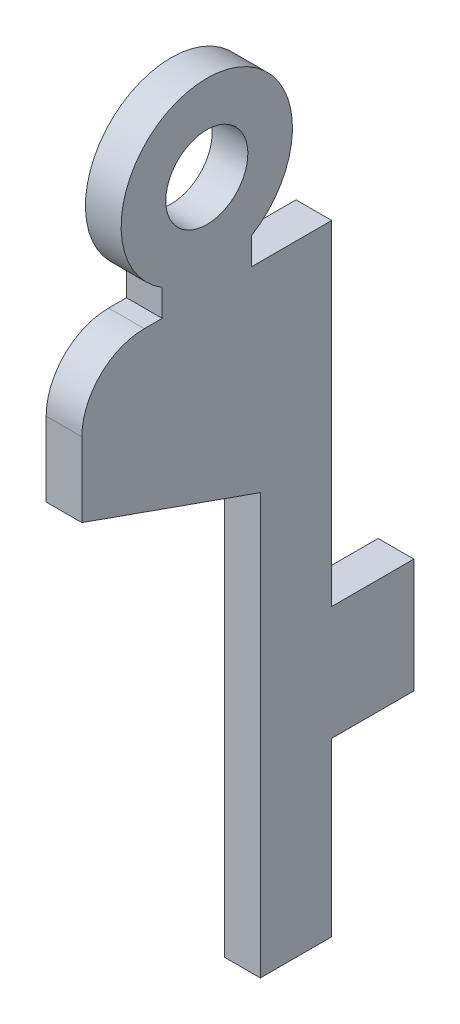
ISO-10303-21;
HEADER;
FILE_DESCRIPTION(('STEP AP214'),'2;1');
FILE_NAME('part.step','',(''),(''),'','','');
FILE_SCHEMA(('AUTOMOTIVE_DESIGN { 1 0 10303 214 1 1 1 1 }'));
ENDSEC;
DATA;
#1=APPLICATION_CONTEXT('core data for automotive mechanical design processes');
#2=APPLICATION_PROTOCOL_DEFINITION('international standard','automotive_design',2000,#1);
#3=PRODUCT_CONTEXT('',#1,'mechanical');
#4=PRODUCT('Part','Part','',(#3));
#5=PRODUCT_RELATED_PRODUCT_CATEGORY('part','',(#4));
#6=PRODUCT_DEFINITION_FORMATION('','',#4);
#7=PRODUCT_DEFINITION_CONTEXT('part definition',#1,'design');
#8=PRODUCT_DEFINITION('design','',#6,#7);
#9=PRODUCT_DEFINITION_SHAPE('','',#8);
#10=(LENGTH_UNIT() NAMED_UNIT(*) SI_UNIT(.MILLI.,.METRE.));
#11=(NAMED_UNIT(*) PLANE_ANGLE_UNIT() SI_UNIT($,.RADIAN.));
#12=(NAMED_UNIT(*) SI_UNIT($,.STERADIAN.) SOLID_ANGLE_UNIT());
#13=UNCERTAINTY_MEASURE_WITH_UNIT(LENGTH_MEASURE(1.E-05),#10,'distance_accuracy_value','');
#14=(GEOMETRIC_REPRESENTATION_CONTEXT(3) GLOBAL_UNCERTAINTY_ASSIGNED_CONTEXT((#13)) GLOBAL_UNIT_ASSIGNED_CONTEXT((#10,
#11,#12)) REPRESENTATION_CONTEXT('',''));
#15=CARTESIAN_POINT('',(0.,0.,0.));
#16=DIRECTION('',(0.,0.,1.));
#17=DIRECTION('',(1.,0.,0.));
#18=AXIS2_PLACEMENT_3D('',#15,#16,#17);
#19=CARTESIAN_POINT('',(-2.35,8.49175045506222,-7.7));
#20=DIRECTION('',(1.,0.,0.));
#21=DIRECTION('',(0.,1.,0.));
#22=AXIS2_PLACEMENT_3D('',#19,#20,#21);
#23=PLANE('',#22);
#24=CARTESIAN_POINT('',(-2.35,17.3808325195312,-6.55));
#25=DIRECTION('',(1.,0.,0.));
#26=DIRECTION('',(0.,1.,0.));
#27=AXIS2_PLACEMENT_3D('',#24,#25,#26);
#28=CIRCLE('',#27,1.15);
#29=CARTESIAN_POINT('',(-2.35,16.2308325195312,-6.55));
#30=VERTEX_POINT('',#29);
#31=EDGE_CURVE('E170',#30,#30,#28,.T.);
#32=ORIENTED_EDGE('',*,*,#31,.F.);
#33=EDGE_LOOP('',(#32));
#34=FACE_BOUND('',#33,.T.);
#35=DIRECTION('',(0.,-1.,0.));
#36=VECTOR('',#35,1.);
#37=CARTESIAN_POINT('',(-2.35,2.01624877929678,-12.35));
#38=LINE('',#37,#36);
#39=CARTESIAN_POINT('',(-2.35,5.21624877929677,-12.35));
#40=VERTEX_POINT('',#39);
#41=CARTESIAN_POINT('',(-2.35,2.01624877929678,-12.35));
#42=VERTEX_POINT('',#41);
#43=EDGE_CURVE('E11',#40,#42,#38,.T.);
#44=ORIENTED_EDGE('',*,*,#43,.F.);
#45=DIRECTION('',(0.,0.,-1.));
#46=VECTOR('',#45,1.);
#47=CARTESIAN_POINT('',(-2.35,5.21624877929677,-12.35));
#48=LINE('',#47,#46);
#49=CARTESIAN_POINT('',(-2.35,5.21624877929677,-10.05));
#50=VERTEX_POINT('',#49);
#51=EDGE_CURVE('E202',#50,#40,#48,.T.);
#52=ORIENTED_EDGE('',*,*,#51,.F.);
#53=DIRECTION('',(0.,-1.,0.));
#54=VECTOR('',#53,1.);
#55=CARTESIAN_POINT('',(-2.35,12.2808325195312,-10.05));
#56=LINE('',#55,#54);
#57=CARTESIAN_POINT('',(-2.35,14.5808325195312,-10.05));
#58=VERTEX_POINT('',#57);
#59=EDGE_CURVE('E243',#58,#50,#56,.T.);
#60=ORIENTED_EDGE('',*,*,#59,.F.);
#61=DIRECTION('',(0.,0.,-1.));
#62=VECTOR('',#61,1.);
#63=CARTESIAN_POINT('',(-2.35,14.5808325195312,-10.05));
#64=LINE('',#63,#62);
#65=CARTESIAN_POINT('',(-2.35,14.5808325195312,-7.8));
#66=VERTEX_POINT('',#65);
#67=EDGE_CURVE('E196',#66,#58,#64,.T.);
#68=ORIENTED_EDGE('',*,*,#67,.F.);
#69=DIRECTION('',(0.,-1.,0.));
#70=VECTOR('',#69,1.);
#71=CARTESIAN_POINT('',(-2.35,14.5808325195312,-7.8));
#72=LINE('',#71,#70);
#73=CARTESIAN_POINT('',(-2.35,15.3320523946764,-7.8));
#74=VERTEX_POINT('',#73);
#75=EDGE_CURVE('E273',#74,#66,#72,.T.);
#76=ORIENTED_EDGE('',*,*,#75,.F.);
#77=CARTESIAN_POINT('',(-2.35,17.3808325195312,-6.55));
#78=DIRECTION('',(-1.,0.,0.));
#79=DIRECTION('',(0.,-0.853658385356162,-0.520833333333333));
#80=AXIS2_PLACEMENT_3D('',#77,#78,#79);
#81=CIRCLE('',#80,2.4);
#82=CARTESIAN_POINT('',(-2.35,15.3320523946764,-5.3));
#83=VERTEX_POINT('',#82);
#84=EDGE_CURVE('E230',#83,#74,#81,.T.);
#85=ORIENTED_EDGE('',*,*,#84,.F.);
#86=DIRECTION('',(0.,1.,0.));
#87=VECTOR('',#86,1.);
#88=CARTESIAN_POINT('',(-2.35,14.5808325195312,-5.3));
#89=LINE('',#88,#87);
#90=CARTESIAN_POINT('',(-2.35,14.5808325195312,-5.3));
#91=VERTEX_POINT('',#90);
#92=EDGE_CURVE('E248',#91,#83,#89,.T.);
#93=ORIENTED_EDGE('',*,*,#92,.F.);
#94=DIRECTION('',(0.,0.,-1.));
#95=VECTOR('',#94,1.);
#96=CARTESIAN_POINT('',(-2.35,14.5808325195312,-5.3));
#97=LINE('',#96,#95);
#98=CARTESIAN_POINT('',(-2.35,14.5808325195312,-4.8));
#99=VERTEX_POINT('',#98);
#100=EDGE_CURVE('E206',#99,#91,#97,.T.);
#101=ORIENTED_EDGE('',*,*,#100,.F.);
#102=CARTESIAN_POINT('',(-2.35,12.8308325195312,-4.8));
#103=DIRECTION('',(-1.,0.,0.));
#104=DIRECTION('',(0.,1.,0.));
#105=AXIS2_PLACEMENT_3D('',#102,#103,#104);
#106=CIRCLE('',#105,1.75);
#107=CARTESIAN_POINT('',(-2.35,12.8308325195312,-3.05));
#108=VERTEX_POINT('',#107);
#109=EDGE_CURVE('E318',#108,#99,#106,.T.);
#110=ORIENTED_EDGE('',*,*,#109,.F.);
#111=DIRECTION('',(0.,1.,0.));
#112=VECTOR('',#111,1.);
#113=CARTESIAN_POINT('',(-2.35,10.7495713865148,-3.05));
#114=LINE('',#113,#112);
#115=CARTESIAN_POINT('',(-2.35,10.7495713865148,-3.05));
#116=VERTEX_POINT('',#115);
#117=EDGE_CURVE('E220',#116,#108,#114,.T.);
#118=ORIENTED_EDGE('',*,*,#117,.F.);
#119=DIRECTION('',(0.,0.334004933719925,0.942571325816115));
#120=VECTOR('',#119,1.);
#121=CARTESIAN_POINT('',(-2.35,10.7495713865148,-3.05));
#122=LINE('',#121,#120);
#123=CARTESIAN_POINT('',(-2.35,8.97779600691296,-8.05));
#124=VERTEX_POINT('',#123);
#125=EDGE_CURVE('E211',#124,#116,#122,.T.);
#126=ORIENTED_EDGE('',*,*,#125,.F.);
#127=DIRECTION('',(0.,1.,0.));
#128=VECTOR('',#127,1.);
#129=CARTESIAN_POINT('',(-2.35,-2.79733160940674,-8.05));
#130=LINE('',#129,#128);
#131=CARTESIAN_POINT('',(-2.35,-2.79733160940674,-8.05));
#132=VERTEX_POINT('',#131);
#133=EDGE_CURVE('E191',#132,#124,#130,.T.);
#134=ORIENTED_EDGE('',*,*,#133,.F.);
#135=DIRECTION('',(0.,0.,1.));
#136=VECTOR('',#135,1.);
#137=CARTESIAN_POINT('',(-2.35,-2.79733160940674,-10.05));
#138=LINE('',#137,#136);
#139=CARTESIAN_POINT('',(-2.35,-2.79733160940674,-10.05));
#140=VERTEX_POINT('',#139);
#141=EDGE_CURVE('E139',#140,#132,#138,.T.);
#142=ORIENTED_EDGE('',*,*,#141,.F.);
#143=DIRECTION('',(0.,-1.,0.));
#144=VECTOR('',#143,1.);
#145=CARTESIAN_POINT('',(-2.35,2.01624877929678,-10.05));
#146=LINE('',#145,#144);
#147=CARTESIAN_POINT('',(-2.35,2.01624877929678,-10.05));
#148=VERTEX_POINT('',#147);
#149=EDGE_CURVE('E235',#148,#140,#146,.T.);
#150=ORIENTED_EDGE('',*,*,#149,.F.);
#151=DIRECTION('',(0.,0.,1.));
#152=VECTOR('',#151,1.);
#153=CARTESIAN_POINT('',(-2.35,2.01624877929678,-12.35));
#154=LINE('',#153,#152);
#155=EDGE_CURVE('E257',#42,#148,#154,.T.);
#156=ORIENTED_EDGE('',*,*,#155,.F.);
#157=EDGE_LOOP('',(#44,#52,#60,#68,#76,#85,#93,#101,#110,#118,#126,#134,#142,#150,#156));
#158=FACE_BOUND('',#157,.T.);
#159=ADVANCED_FACE('F17',(#34,#158),#23,.T.);
#160=CARTESIAN_POINT('',(-3.35,8.49175045506222,-7.7));
#161=DIRECTION('',(1.,0.,0.));
#162=DIRECTION('',(0.,1.,0.));
#163=AXIS2_PLACEMENT_3D('',#160,#161,#162);
#164=PLANE('',#163);
#165=CARTESIAN_POINT('',(-3.35,17.3808325195312,-6.55));
#166=DIRECTION('',(-1.,0.,0.));
#167=DIRECTION('',(0.,1.,0.));
#168=AXIS2_PLACEMENT_3D('',#165,#166,#167);
#169=CIRCLE('',#168,1.15);
#170=CARTESIAN_POINT('',(-3.35,16.2308325195312,-6.55));
#171=VERTEX_POINT('',#170);
#172=EDGE_CURVE('E172',#171,#171,#169,.T.);
#173=ORIENTED_EDGE('',*,*,#172,.F.);
#174=EDGE_LOOP('',(#173));
#175=FACE_BOUND('',#174,.T.);
#176=DIRECTION('',(0.,1.,0.));
#177=VECTOR('',#176,1.);
#178=CARTESIAN_POINT('',(-3.35,2.01624877929678,-12.35));
#179=LINE('',#178,#177);
#180=CARTESIAN_POINT('',(-3.35,2.01624877929678,-12.35));
#181=VERTEX_POINT('',#180);
#182=CARTESIAN_POINT('',(-3.35,5.21624877929677,-12.35));
#183=VERTEX_POINT('',#182);
#184=EDGE_CURVE('E28',#181,#183,#179,.T.);
#185=ORIENTED_EDGE('',*,*,#184,.F.);
#186=DIRECTION('',(0.,0.,1.));
#187=VECTOR('',#186,1.);
#188=CARTESIAN_POINT('',(-3.35,2.01624877929678,-12.35));
#189=LINE('',#188,#187);
#190=CARTESIAN_POINT('',(-3.35,2.01624877929678,-10.05));
#191=VERTEX_POINT('',#190);
#192=EDGE_CURVE('E238',#181,#191,#189,.T.);
#193=ORIENTED_EDGE('',*,*,#192,.T.);
#194=DIRECTION('',(0.,-1.,0.));
#195=VECTOR('',#194,1.);
#196=CARTESIAN_POINT('',(-3.35,2.01624877929678,-10.05));
#197=LINE('',#196,#195);
#198=CARTESIAN_POINT('',(-3.35,-2.79733160940674,-10.05));
#199=VERTEX_POINT('',#198);
#200=EDGE_CURVE('E130',#191,#199,#197,.T.);
#201=ORIENTED_EDGE('',*,*,#200,.T.);
#202=DIRECTION('',(0.,0.,1.));
#203=VECTOR('',#202,1.);
#204=CARTESIAN_POINT('',(-3.35,-2.79733160940674,-10.05));
#205=LINE('',#204,#203);
#206=CARTESIAN_POINT('',(-3.35,-2.79733160940674,-8.05));
#207=VERTEX_POINT('',#206);
#208=EDGE_CURVE('E144',#199,#207,#205,.T.);
#209=ORIENTED_EDGE('',*,*,#208,.T.);
#210=DIRECTION('',(0.,1.,0.));
#211=VECTOR('',#210,1.);
#212=CARTESIAN_POINT('',(-3.35,-2.79733160940674,-8.05));
#213=LINE('',#212,#211);
#214=CARTESIAN_POINT('',(-3.35,8.97779600691296,-8.05));
#215=VERTEX_POINT('',#214);
#216=EDGE_CURVE('E21',#207,#215,#213,.T.);
#217=ORIENTED_EDGE('',*,*,#216,.T.);
#218=DIRECTION('',(0.,-0.334004933719925,-0.942571325816115));
#219=VECTOR('',#218,1.);
#220=CARTESIAN_POINT('',(-3.35,10.7495713865148,-3.05));
#221=LINE('',#220,#219);
#222=CARTESIAN_POINT('',(-3.35,10.7495713865148,-3.05));
#223=VERTEX_POINT('',#222);
#224=EDGE_CURVE('E212',#223,#215,#221,.T.);
#225=ORIENTED_EDGE('',*,*,#224,.F.);
#226=DIRECTION('',(0.,1.,0.));
#227=VECTOR('',#226,1.);
#228=CARTESIAN_POINT('',(-3.35,10.7495713865148,-3.05));
#229=LINE('',#228,#227);
#230=CARTESIAN_POINT('',(-3.35,12.8308325195312,-3.05));
#231=VERTEX_POINT('',#230);
#232=EDGE_CURVE('E281',#223,#231,#229,.T.);
#233=ORIENTED_EDGE('',*,*,#232,.T.);
#234=CARTESIAN_POINT('',(-3.35,12.8308325195312,-4.8));
#235=DIRECTION('',(1.,0.,0.));
#236=DIRECTION('',(0.,1.,0.));
#237=AXIS2_PLACEMENT_3D('',#234,#235,#236);
#238=CIRCLE('',#237,1.75);
#239=CARTESIAN_POINT('',(-3.35,14.5808325195312,-4.8));
#240=VERTEX_POINT('',#239);
#241=EDGE_CURVE('E321',#240,#231,#238,.T.);
#242=ORIENTED_EDGE('',*,*,#241,.F.);
#243=DIRECTION('',(0.,0.,1.));
#244=VECTOR('',#243,1.);
#245=CARTESIAN_POINT('',(-3.35,14.5808325195312,-5.3));
#246=LINE('',#245,#244);
#247=CARTESIAN_POINT('',(-3.35,14.5808325195312,-5.3));
#248=VERTEX_POINT('',#247);
#249=EDGE_CURVE('E207',#248,#240,#246,.T.);
#250=ORIENTED_EDGE('',*,*,#249,.F.);
#251=DIRECTION('',(0.,1.,0.));
#252=VECTOR('',#251,1.);
#253=CARTESIAN_POINT('',(-3.35,14.5808325195312,-5.3));
#254=LINE('',#253,#252);
#255=CARTESIAN_POINT('',(-3.35,15.3320523946764,-5.3));
#256=VERTEX_POINT('',#255);
#257=EDGE_CURVE('E233',#248,#256,#254,.T.);
#258=ORIENTED_EDGE('',*,*,#257,.T.);
#259=CARTESIAN_POINT('',(-3.35,17.3808325195312,-6.55));
#260=DIRECTION('',(1.,0.,0.));
#261=DIRECTION('',(0.,-0.853658385356162,-0.520833333333333));
#262=AXIS2_PLACEMENT_3D('',#259,#260,#261);
#263=CIRCLE('',#262,2.4);
#264=CARTESIAN_POINT('',(-3.35,15.3320523946764,-7.8));
#265=VERTEX_POINT('',#264);
#266=EDGE_CURVE('E276',#265,#256,#263,.T.);
#267=ORIENTED_EDGE('',*,*,#266,.F.);
#268=DIRECTION('',(0.,1.,0.));
#269=VECTOR('',#268,1.);
#270=CARTESIAN_POINT('',(-3.35,14.5808325195312,-7.8));
#271=LINE('',#270,#269);
#272=CARTESIAN_POINT('',(-3.35,14.5808325195312,-7.8));
#273=VERTEX_POINT('',#272);
#274=EDGE_CURVE('E272',#273,#265,#271,.T.);
#275=ORIENTED_EDGE('',*,*,#274,.F.);
#276=DIRECTION('',(0.,0.,1.));
#277=VECTOR('',#276,1.);
#278=CARTESIAN_POINT('',(-3.35,14.5808325195312,-10.05));
#279=LINE('',#278,#277);
#280=CARTESIAN_POINT('',(-3.35,14.5808325195312,-10.05));
#281=VERTEX_POINT('',#280);
#282=EDGE_CURVE('E197',#281,#273,#279,.T.);
#283=ORIENTED_EDGE('',*,*,#282,.F.);
#284=DIRECTION('',(0.,-1.,0.));
#285=VECTOR('',#284,1.);
#286=CARTESIAN_POINT('',(-3.35,12.2808325195312,-10.05));
#287=LINE('',#286,#285);
#288=CARTESIAN_POINT('',(-3.35,5.21624877929677,-10.05));
#289=VERTEX_POINT('',#288);
#290=EDGE_CURVE('E201',#281,#289,#287,.T.);
#291=ORIENTED_EDGE('',*,*,#290,.T.);
#292=DIRECTION('',(0.,0.,1.));
#293=VECTOR('',#292,1.);
#294=CARTESIAN_POINT('',(-3.35,5.21624877929677,-12.35));
#295=LINE('',#294,#293);
#296=EDGE_CURVE('E180',#183,#289,#295,.T.);
#297=ORIENTED_EDGE('',*,*,#296,.F.);
#298=EDGE_LOOP('',(#185,#193,#201,#209,#217,#225,#233,#242,#250,#258,#267,#275,#283,#291,#297));
#299=FACE_BOUND('',#298,.T.);
#300=ADVANCED_FACE('F328',(#175,#299),#164,.F.);
#301=CARTESIAN_POINT('',(-3.35,5.21624877929677,-12.35));
#302=DIRECTION('',(0.,0.,1.));
#303=DIRECTION('',(1.,0.,0.));
#304=AXIS2_PLACEMENT_3D('',#301,#302,#303);
#305=PLANE('',#304);
#306=ORIENTED_EDGE('',*,*,#184,.T.);
#307=DIRECTION('',(1.,0.,0.));
#308=VECTOR('',#307,1.);
#309=CARTESIAN_POINT('',(-3.35,5.21624877929677,-12.35));
#310=LINE('',#309,#308);
#311=EDGE_CURVE('E198',#183,#40,#310,.T.);
#312=ORIENTED_EDGE('',*,*,#311,.T.);
#313=ORIENTED_EDGE('',*,*,#43,.T.);
#314=DIRECTION('',(1.,0.,0.));
#315=VECTOR('',#314,1.);
#316=CARTESIAN_POINT('',(-3.35,2.01624877929678,-12.35));
#317=LINE('',#316,#315);
#318=EDGE_CURVE('E253',#181,#42,#317,.T.);
#319=ORIENTED_EDGE('',*,*,#318,.F.);
#320=EDGE_LOOP('',(#306,#312,#313,#319));
#321=FACE_BOUND('',#320,.T.);
#322=ADVANCED_FACE('F494',(#321),#305,.F.);
#323=CARTESIAN_POINT('',(-3.35,2.01624877929678,-12.35));
#324=DIRECTION('',(0.,1.,0.));
#325=DIRECTION('',(1.,0.,0.));
#326=AXIS2_PLACEMENT_3D('',#323,#324,#325);
#327=PLANE('',#326);
#328=ORIENTED_EDGE('',*,*,#192,.F.);
#329=ORIENTED_EDGE('',*,*,#318,.T.);
#330=ORIENTED_EDGE('',*,*,#155,.T.);
#331=DIRECTION('',(1.,0.,0.));
#332=VECTOR('',#331,1.);
#333=CARTESIAN_POINT('',(-3.35,2.01624877929678,-10.05));
#334=LINE('',#333,#332);
#335=EDGE_CURVE('E239',#191,#148,#334,.T.);
#336=ORIENTED_EDGE('',*,*,#335,.F.);
#337=EDGE_LOOP('',(#328,#329,#330,#336));
#338=FACE_BOUND('',#337,.T.);
#339=ADVANCED_FACE('F365',(#338),#327,.F.);
#340=CARTESIAN_POINT('',(-3.35,2.01624877929678,-10.05));
#341=DIRECTION('',(0.,0.,1.));
#342=DIRECTION('',(1.,0.,0.));
#343=AXIS2_PLACEMENT_3D('',#340,#341,#342);
#344=PLANE('',#343);
#345=ORIENTED_EDGE('',*,*,#200,.F.);
#346=ORIENTED_EDGE('',*,*,#335,.T.);
#347=ORIENTED_EDGE('',*,*,#149,.T.);
#348=DIRECTION('',(1.,0.,0.));
#349=VECTOR('',#348,1.);
#350=CARTESIAN_POINT('',(-3.35,-2.79733160940674,-10.05));
#351=LINE('',#350,#349);
#352=EDGE_CURVE('E262',#199,#140,#351,.T.);
#353=ORIENTED_EDGE('',*,*,#352,.F.);
#354=EDGE_LOOP('',(#345,#346,#347,#353));
#355=FACE_BOUND('',#354,.T.);
#356=ADVANCED_FACE('F19',(#355),#344,.F.);
#357=CARTESIAN_POINT('',(-3.35,-2.79733160940674,-10.05));
#358=DIRECTION('',(0.,1.,0.));
#359=DIRECTION('',(1.,0.,0.));
#360=AXIS2_PLACEMENT_3D('',#357,#358,#359);
#361=PLANE('',#360);
#362=ORIENTED_EDGE('',*,*,#208,.F.);
#363=ORIENTED_EDGE('',*,*,#352,.T.);
#364=ORIENTED_EDGE('',*,*,#141,.T.);
#365=DIRECTION('',(1.,0.,0.));
#366=VECTOR('',#365,1.);
#367=CARTESIAN_POINT('',(-3.35,-2.79733160940674,-8.05));
#368=LINE('',#367,#366);
#369=EDGE_CURVE('E187',#207,#132,#368,.T.);
#370=ORIENTED_EDGE('',*,*,#369,.F.);
#371=EDGE_LOOP('',(#362,#363,#364,#370));
#372=FACE_BOUND('',#371,.T.);
#373=ADVANCED_FACE('F368',(#372),#361,.F.);
#374=CARTESIAN_POINT('',(-3.35,-2.79733160940674,-8.05));
#375=DIRECTION('',(0.,0.,-1.));
#376=DIRECTION('',(-1.,0.,0.));
#377=AXIS2_PLACEMENT_3D('',#374,#375,#376);
#378=PLANE('',#377);
#379=ORIENTED_EDGE('',*,*,#216,.F.);
#380=ORIENTED_EDGE('',*,*,#369,.T.);
#381=ORIENTED_EDGE('',*,*,#133,.T.);
#382=DIRECTION('',(1.,0.,0.));
#383=VECTOR('',#382,1.);
#384=CARTESIAN_POINT('',(-3.35,8.97779600691296,-8.05));
#385=LINE('',#384,#383);
#386=EDGE_CURVE('E208',#215,#124,#385,.T.);
#387=ORIENTED_EDGE('',*,*,#386,.F.);
#388=EDGE_LOOP('',(#379,#380,#381,#387));
#389=FACE_BOUND('',#388,.T.);
#390=ADVANCED_FACE('F371',(#389),#378,.F.);
#391=CARTESIAN_POINT('',(-3.35,8.97779600691296,-8.05));
#392=DIRECTION('',(0.,0.942571325816115,-0.334004933719925));
#393=DIRECTION('',(-1.,0.,0.));
#394=AXIS2_PLACEMENT_3D('',#391,#392,#393);
#395=PLANE('',#394);
#396=ORIENTED_EDGE('',*,*,#224,.T.);
#397=ORIENTED_EDGE('',*,*,#386,.T.);
#398=ORIENTED_EDGE('',*,*,#125,.T.);
#399=DIRECTION('',(1.,0.,0.));
#400=VECTOR('',#399,1.);
#401=CARTESIAN_POINT('',(-3.35,10.7495713865148,-3.05));
#402=LINE('',#401,#400);
#403=EDGE_CURVE('E226',#223,#116,#402,.T.);
#404=ORIENTED_EDGE('',*,*,#403,.F.);
#405=EDGE_LOOP('',(#396,#397,#398,#404));
#406=FACE_BOUND('',#405,.T.);
#407=ADVANCED_FACE('F518',(#406),#395,.F.);
#408=CARTESIAN_POINT('',(-3.35,10.7495713865148,-3.05));
#409=DIRECTION('',(0.,0.,-1.));
#410=DIRECTION('',(0.,-1.,0.));
#411=AXIS2_PLACEMENT_3D('',#408,#409,#410);
#412=PLANE('',#411);
#413=ORIENTED_EDGE('',*,*,#232,.F.);
#414=ORIENTED_EDGE('',*,*,#403,.T.);
#415=ORIENTED_EDGE('',*,*,#117,.T.);
#416=DIRECTION('',(1.,0.,0.));
#417=VECTOR('',#416,1.);
#418=CARTESIAN_POINT('',(-3.35,12.8308325195312,-3.05));
#419=LINE('',#418,#417);
#420=EDGE_CURVE('E185',#231,#108,#419,.T.);
#421=ORIENTED_EDGE('',*,*,#420,.F.);
#422=EDGE_LOOP('',(#413,#414,#415,#421));
#423=FACE_BOUND('',#422,.T.);
#424=ADVANCED_FACE('F332',(#423),#412,.F.);
#425=CARTESIAN_POINT('',(-3.35,12.8308325195312,-4.8));
#426=DIRECTION('',(-1.,0.,0.));
#427=DIRECTION('',(0.,1.,0.));
#428=AXIS2_PLACEMENT_3D('',#425,#426,#427);
#429=CYLINDRICAL_SURFACE('',#428,1.75);
#430=ORIENTED_EDGE('',*,*,#241,.T.);
#431=ORIENTED_EDGE('',*,*,#420,.T.);
#432=ORIENTED_EDGE('',*,*,#109,.T.);
#433=DIRECTION('',(1.,0.,0.));
#434=VECTOR('',#433,1.);
#435=CARTESIAN_POINT('',(-3.35,14.5808325195312,-4.8));
#436=LINE('',#435,#434);
#437=EDGE_CURVE('E203',#240,#99,#436,.T.);
#438=ORIENTED_EDGE('',*,*,#437,.F.);
#439=EDGE_LOOP('',(#430,#431,#432,#438));
#440=FACE_BOUND('',#439,.T.);
#441=ADVANCED_FACE('F337',(#440),#429,.T.);
#442=CARTESIAN_POINT('',(-3.35,14.5808325195312,-4.8));
#443=DIRECTION('',(0.,-1.,0.));
#444=DIRECTION('',(0.,0.,-1.));
#445=AXIS2_PLACEMENT_3D('',#442,#443,#444);
#446=PLANE('',#445);
#447=ORIENTED_EDGE('',*,*,#249,.T.);
#448=ORIENTED_EDGE('',*,*,#437,.T.);
#449=ORIENTED_EDGE('',*,*,#100,.T.);
#450=DIRECTION('',(1.,0.,0.));
#451=VECTOR('',#450,1.);
#452=CARTESIAN_POINT('',(-3.35,14.5808325195312,-5.3));
#453=LINE('',#452,#451);
#454=EDGE_CURVE('E244',#248,#91,#453,.T.);
#455=ORIENTED_EDGE('',*,*,#454,.F.);
#456=EDGE_LOOP('',(#447,#448,#449,#455));
#457=FACE_BOUND('',#456,.T.);
#458=ADVANCED_FACE('F341',(#457),#446,.F.);
#459=CARTESIAN_POINT('',(-3.35,14.5808325195312,-5.3));
#460=DIRECTION('',(0.,0.,-1.));
#461=DIRECTION('',(0.,-1.,0.));
#462=AXIS2_PLACEMENT_3D('',#459,#460,#461);
#463=PLANE('',#462);
#464=ORIENTED_EDGE('',*,*,#257,.F.);
#465=ORIENTED_EDGE('',*,*,#454,.T.);
#466=ORIENTED_EDGE('',*,*,#92,.T.);
#467=DIRECTION('',(1.,0.,0.));
#468=VECTOR('',#467,1.);
#469=CARTESIAN_POINT('',(-3.35,15.3320523946764,-5.3));
#470=LINE('',#469,#468);
#471=EDGE_CURVE('E234',#256,#83,#470,.T.);
#472=ORIENTED_EDGE('',*,*,#471,.F.);
#473=EDGE_LOOP('',(#464,#465,#466,#472));
#474=FACE_BOUND('',#473,.T.);
#475=ADVANCED_FACE('F350',(#474),#463,.F.);
#476=CARTESIAN_POINT('',(-3.35,17.3808325195312,-6.55));
#477=DIRECTION('',(-1.,0.,0.));
#478=DIRECTION('',(0.,1.,0.));
#479=AXIS2_PLACEMENT_3D('',#476,#477,#478);
#480=CYLINDRICAL_SURFACE('',#479,2.4);
#481=ORIENTED_EDGE('',*,*,#266,.T.);
#482=ORIENTED_EDGE('',*,*,#471,.T.);
#483=ORIENTED_EDGE('',*,*,#84,.T.);
#484=DIRECTION('',(1.,0.,0.));
#485=VECTOR('',#484,1.);
#486=CARTESIAN_POINT('',(-3.35,15.3320523946764,-7.8));
#487=LINE('',#486,#485);
#488=EDGE_CURVE('E277',#265,#74,#487,.T.);
#489=ORIENTED_EDGE('',*,*,#488,.F.);
#490=EDGE_LOOP('',(#481,#482,#483,#489));
#491=FACE_BOUND('',#490,.T.);
#492=ADVANCED_FACE('F354',(#491),#480,.T.);
#493=CARTESIAN_POINT('',(-3.35,15.3320523946764,-7.8));
#494=DIRECTION('',(0.,0.,1.));
#495=DIRECTION('',(1.,0.,0.));
#496=AXIS2_PLACEMENT_3D('',#493,#494,#495);
#497=PLANE('',#496);
#498=ORIENTED_EDGE('',*,*,#274,.T.);
#499=ORIENTED_EDGE('',*,*,#488,.T.);
#500=ORIENTED_EDGE('',*,*,#75,.T.);
#501=DIRECTION('',(1.,0.,0.));
#502=VECTOR('',#501,1.);
#503=CARTESIAN_POINT('',(-3.35,14.5808325195312,-7.8));
#504=LINE('',#503,#502);
#505=EDGE_CURVE('E192',#273,#66,#504,.T.);
#506=ORIENTED_EDGE('',*,*,#505,.F.);
#507=EDGE_LOOP('',(#498,#499,#500,#506));
#508=FACE_BOUND('',#507,.T.);
#509=ADVANCED_FACE('F475',(#508),#497,.F.);
#510=CARTESIAN_POINT('',(-3.35,14.5808325195312,-7.8));
#511=DIRECTION('',(0.,-1.,0.));
#512=DIRECTION('',(0.,0.,-1.));
#513=AXIS2_PLACEMENT_3D('',#510,#511,#512);
#514=PLANE('',#513);
#515=ORIENTED_EDGE('',*,*,#282,.T.);
#516=ORIENTED_EDGE('',*,*,#505,.T.);
#517=ORIENTED_EDGE('',*,*,#67,.T.);
#518=DIRECTION('',(1.,0.,0.));
#519=VECTOR('',#518,1.);
#520=CARTESIAN_POINT('',(-3.35,14.5808325195312,-10.05));
#521=LINE('',#520,#519);
#522=EDGE_CURVE('E282',#281,#58,#521,.T.);
#523=ORIENTED_EDGE('',*,*,#522,.F.);
#524=EDGE_LOOP('',(#515,#516,#517,#523));
#525=FACE_BOUND('',#524,.T.);
#526=ADVANCED_FACE('F529',(#525),#514,.F.);
#527=CARTESIAN_POINT('',(-3.35,14.5808325195312,-10.05));
#528=DIRECTION('',(0.,0.,1.));
#529=DIRECTION('',(1.,0.,0.));
#530=AXIS2_PLACEMENT_3D('',#527,#528,#529);
#531=PLANE('',#530);
#532=ORIENTED_EDGE('',*,*,#290,.F.);
#533=ORIENTED_EDGE('',*,*,#522,.T.);
#534=ORIENTED_EDGE('',*,*,#59,.T.);
#535=DIRECTION('',(1.,0.,0.));
#536=VECTOR('',#535,1.);
#537=CARTESIAN_POINT('',(-3.35,5.21624877929677,-10.05));
#538=LINE('',#537,#536);
#539=EDGE_CURVE('E252',#289,#50,#538,.T.);
#540=ORIENTED_EDGE('',*,*,#539,.F.);
#541=EDGE_LOOP('',(#532,#533,#534,#540));
#542=FACE_BOUND('',#541,.T.);
#543=ADVANCED_FACE('F489',(#542),#531,.F.);
#544=CARTESIAN_POINT('',(-3.35,5.21624877929677,-10.05));
#545=DIRECTION('',(0.,-1.,0.));
#546=DIRECTION('',(0.,0.,-1.));
#547=AXIS2_PLACEMENT_3D('',#544,#545,#546);
#548=PLANE('',#547);
#549=ORIENTED_EDGE('',*,*,#296,.T.);
#550=ORIENTED_EDGE('',*,*,#539,.T.);
#551=ORIENTED_EDGE('',*,*,#51,.T.);
#552=ORIENTED_EDGE('',*,*,#311,.F.);
#553=EDGE_LOOP('',(#549,#550,#551,#552));
#554=FACE_BOUND('',#553,.T.);
#555=ADVANCED_FACE('F493',(#554),#548,.F.);
#556=CARTESIAN_POINT('',(-3.35,17.3808325195312,-6.55));
#557=DIRECTION('',(-1.,0.,0.));
#558=DIRECTION('',(0.,1.,0.));
#559=AXIS2_PLACEMENT_3D('',#556,#557,#558);
#560=CYLINDRICAL_SURFACE('',#559,1.15);
#561=ORIENTED_EDGE('',*,*,#31,.T.);
#562=DIRECTION('',(-1.,0.,0.));
#563=VECTOR('',#562,1.);
#564=CARTESIAN_POINT('',(-3.35,16.2308325195312,-6.55));
#565=LINE('',#564,#563);
#566=EDGE_CURVE('E167',#30,#171,#565,.T.);
#567=ORIENTED_EDGE('',*,*,#566,.T.);
#568=ORIENTED_EDGE('',*,*,#172,.T.);
#569=ORIENTED_EDGE('',*,*,#566,.F.);
#570=EDGE_LOOP('',(#561,#567,#568,#569));
#571=FACE_BOUND('',#570,.T.);
#572=ADVANCED_FACE('F168',(#571),#560,.F.);
#573=CLOSED_SHELL('',(#159,#300,#322,#339,#356,#373,#390,#407,#424,#441,#458,#475,#492,#509,
#526,#543,#555,#572));
#574=MANIFOLD_SOLID_BREP('B1',#573);
#575=ADVANCED_BREP_SHAPE_REPRESENTATION('',(#18,#574),#14);
#576=SHAPE_DEFINITION_REPRESENTATION(#9,#575);
ENDSEC;
END-ISO-10303-21;
